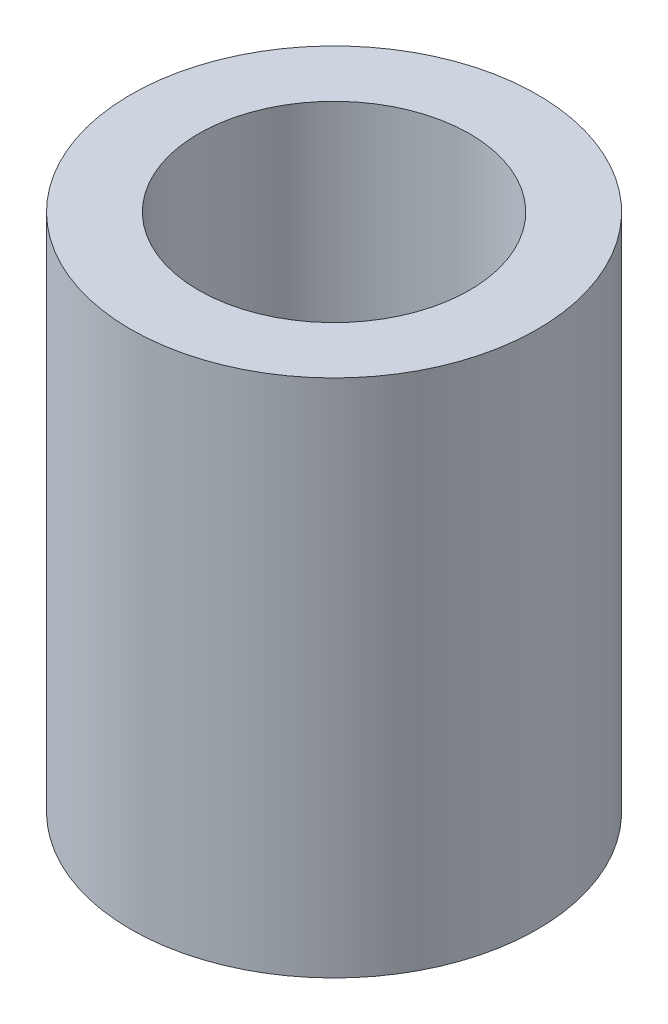
ISO-10303-21;
HEADER;
FILE_DESCRIPTION(('STEP AP214'),'2;1');
FILE_NAME('part.step','',(''),(''),'','','');
FILE_SCHEMA(('AUTOMOTIVE_DESIGN { 1 0 10303 214 1 1 1 1 }'));
ENDSEC;
DATA;
#1=APPLICATION_CONTEXT('core data for automotive mechanical design processes');
#2=APPLICATION_PROTOCOL_DEFINITION('international standard','automotive_design',2000,#1);
#3=PRODUCT_CONTEXT('',#1,'mechanical');
#4=PRODUCT('Part','Part','',(#3));
#5=PRODUCT_RELATED_PRODUCT_CATEGORY('part','',(#4));
#6=PRODUCT_DEFINITION_FORMATION('','',#4);
#7=PRODUCT_DEFINITION_CONTEXT('part definition',#1,'design');
#8=PRODUCT_DEFINITION('design','',#6,#7);
#9=PRODUCT_DEFINITION_SHAPE('','',#8);
#10=(LENGTH_UNIT() NAMED_UNIT(*) SI_UNIT(.MILLI.,.METRE.));
#11=(NAMED_UNIT(*) PLANE_ANGLE_UNIT() SI_UNIT($,.RADIAN.));
#12=(NAMED_UNIT(*) SI_UNIT($,.STERADIAN.) SOLID_ANGLE_UNIT());
#13=UNCERTAINTY_MEASURE_WITH_UNIT(LENGTH_MEASURE(1.E-05),#10,'distance_accuracy_value','');
#14=(GEOMETRIC_REPRESENTATION_CONTEXT(3) GLOBAL_UNCERTAINTY_ASSIGNED_CONTEXT((#13)) GLOBAL_UNIT_ASSIGNED_CONTEXT((#10,
#11,#12)) REPRESENTATION_CONTEXT('',''));
#15=CARTESIAN_POINT('',(0.,0.,0.));
#16=DIRECTION('',(0.,0.,1.));
#17=DIRECTION('',(1.,0.,0.));
#18=AXIS2_PLACEMENT_3D('',#15,#16,#17);
#19=CARTESIAN_POINT('',(-2.5,0.,1.5));
#20=DIRECTION('',(0.,1.,0.));
#21=DIRECTION('',(0.,0.,1.));
#22=AXIS2_PLACEMENT_3D('',#19,#20,#21);
#23=PLANE('',#22);
#24=CARTESIAN_POINT('',(-2.5,0.,1.5));
#25=DIRECTION('',(0.,1.,0.));
#26=DIRECTION('',(0.,0.,1.));
#27=AXIS2_PLACEMENT_3D('',#24,#25,#26);
#28=CIRCLE('',#27,4.5);
#29=CARTESIAN_POINT('',(-2.5,0.,6.));
#30=VERTEX_POINT('',#29);
#31=EDGE_CURVE('E11',#30,#30,#28,.T.);
#32=ORIENTED_EDGE('',*,*,#31,.F.);
#33=EDGE_LOOP('',(#32));
#34=FACE_BOUND('',#33,.T.);
#35=CARTESIAN_POINT('',(-4.5,0.,2.5));
#36=DIRECTION('',(0.,1.,0.));
#37=DIRECTION('',(0.,0.,-1.));
#38=AXIS2_PLACEMENT_3D('',#35,#36,#37);
#39=CIRCLE('',#38,0.5);
#40=CARTESIAN_POINT('',(-5.,0.,2.5));
#41=VERTEX_POINT('',#40);
#42=CARTESIAN_POINT('',(-4.5,0.,3.));
#43=VERTEX_POINT('',#42);
#44=EDGE_CURVE('E49',#41,#43,#39,.T.);
#45=ORIENTED_EDGE('',*,*,#44,.T.);
#46=DIRECTION('',(1.,0.,0.));
#47=VECTOR('',#46,1.);
#48=CARTESIAN_POINT('',(-0.500000000000003,0.,3.));
#49=LINE('',#48,#47);
#50=CARTESIAN_POINT('',(-0.500000000000003,0.,3.));
#51=VERTEX_POINT('',#50);
#52=EDGE_CURVE('E135',#43,#51,#49,.T.);
#53=ORIENTED_EDGE('',*,*,#52,.T.);
#54=CARTESIAN_POINT('',(-0.5,0.,2.5));
#55=DIRECTION('',(0.,1.,0.));
#56=DIRECTION('',(0.,0.,-1.));
#57=AXIS2_PLACEMENT_3D('',#54,#55,#56);
#58=CIRCLE('',#57,0.5);
#59=CARTESIAN_POINT('',(0.,0.,2.5));
#60=VERTEX_POINT('',#59);
#61=EDGE_CURVE('E138',#51,#60,#58,.T.);
#62=ORIENTED_EDGE('',*,*,#61,.T.);
#63=DIRECTION('',(0.,0.,-1.));
#64=VECTOR('',#63,1.);
#65=CARTESIAN_POINT('',(0.,0.,0.500000000000003));
#66=LINE('',#65,#64);
#67=CARTESIAN_POINT('',(0.,0.,0.500000000000003));
#68=VERTEX_POINT('',#67);
#69=EDGE_CURVE('E114',#60,#68,#66,.T.);
#70=ORIENTED_EDGE('',*,*,#69,.T.);
#71=CARTESIAN_POINT('',(-0.5,0.,0.5));
#72=DIRECTION('',(0.,1.,0.));
#73=DIRECTION('',(0.,0.,-1.));
#74=AXIS2_PLACEMENT_3D('',#71,#72,#73);
#75=CIRCLE('',#74,0.5);
#76=CARTESIAN_POINT('',(-0.500000000000003,0.,0.));
#77=VERTEX_POINT('',#76);
#78=EDGE_CURVE('E112',#68,#77,#75,.T.);
#79=ORIENTED_EDGE('',*,*,#78,.T.);
#80=DIRECTION('',(-1.,0.,0.));
#81=VECTOR('',#80,1.);
#82=CARTESIAN_POINT('',(-0.500000000000003,0.,0.));
#83=LINE('',#82,#81);
#84=CARTESIAN_POINT('',(-4.5,0.,0.));
#85=VERTEX_POINT('',#84);
#86=EDGE_CURVE('E91',#77,#85,#83,.T.);
#87=ORIENTED_EDGE('',*,*,#86,.T.);
#88=CARTESIAN_POINT('',(-4.5,0.,0.5));
#89=DIRECTION('',(0.,1.,0.));
#90=DIRECTION('',(0.,0.,-1.));
#91=AXIS2_PLACEMENT_3D('',#88,#89,#90);
#92=CIRCLE('',#91,0.5);
#93=CARTESIAN_POINT('',(-5.,0.,0.500000000000004));
#94=VERTEX_POINT('',#93);
#95=EDGE_CURVE('E102',#85,#94,#92,.T.);
#96=ORIENTED_EDGE('',*,*,#95,.T.);
#97=DIRECTION('',(0.,0.,1.));
#98=VECTOR('',#97,1.);
#99=CARTESIAN_POINT('',(-5.,0.,0.500000000000003));
#100=LINE('',#99,#98);
#101=EDGE_CURVE('E108',#94,#41,#100,.T.);
#102=ORIENTED_EDGE('',*,*,#101,.T.);
#103=EDGE_LOOP('',(#45,#53,#62,#70,#79,#87,#96,#102));
#104=FACE_BOUND('',#103,.T.);
#105=ADVANCED_FACE('F34',(#34,#104),#23,.F.);
#106=CARTESIAN_POINT('',(-2.5,5.5,1.5));
#107=DIRECTION('',(0.,-1.,0.));
#108=DIRECTION('',(0.,0.,-1.));
#109=AXIS2_PLACEMENT_3D('',#106,#107,#108);
#110=CYLINDRICAL_SURFACE('',#109,4.5);
#111=ORIENTED_EDGE('',*,*,#31,.T.);
#112=EDGE_LOOP('',(#111));
#113=FACE_BOUND('',#112,.T.);
#114=CARTESIAN_POINT('',(-2.5,11.5,1.5));
#115=DIRECTION('',(0.,1.,0.));
#116=DIRECTION('',(0.,0.,1.));
#117=AXIS2_PLACEMENT_3D('',#114,#115,#116);
#118=CIRCLE('',#117,4.5);
#119=CARTESIAN_POINT('',(-2.5,11.5,6.));
#120=VERTEX_POINT('',#119);
#121=EDGE_CURVE('E136',#120,#120,#118,.T.);
#122=ORIENTED_EDGE('',*,*,#121,.F.);
#123=EDGE_LOOP('',(#122));
#124=FACE_BOUND('',#123,.T.);
#125=ADVANCED_FACE('F36',(#113,#124),#110,.T.);
#126=CARTESIAN_POINT('',(-4.5,5.5,2.5));
#127=DIRECTION('',(0.,-1.,0.));
#128=DIRECTION('',(0.,0.,-1.));
#129=AXIS2_PLACEMENT_3D('',#126,#127,#128);
#130=CYLINDRICAL_SURFACE('',#129,0.5);
#131=ORIENTED_EDGE('',*,*,#44,.F.);
#132=DIRECTION('',(0.,-1.,0.));
#133=VECTOR('',#132,1.);
#134=CARTESIAN_POINT('',(-5.,5.5,2.5));
#135=LINE('',#134,#133);
#136=CARTESIAN_POINT('',(-5.,5.5,2.5));
#137=VERTEX_POINT('',#136);
#138=EDGE_CURVE('E119',#137,#41,#135,.T.);
#139=ORIENTED_EDGE('',*,*,#138,.F.);
#140=CARTESIAN_POINT('',(-4.5,5.5,2.5));
#141=DIRECTION('',(0.,1.,0.));
#142=DIRECTION('',(0.,0.,-1.));
#143=AXIS2_PLACEMENT_3D('',#140,#141,#142);
#144=CIRCLE('',#143,0.5);
#145=CARTESIAN_POINT('',(-4.5,5.5,3.));
#146=VERTEX_POINT('',#145);
#147=EDGE_CURVE('E58',#137,#146,#144,.T.);
#148=ORIENTED_EDGE('',*,*,#147,.T.);
#149=DIRECTION('',(0.,-1.,0.));
#150=VECTOR('',#149,1.);
#151=CARTESIAN_POINT('',(-4.5,5.5,3.));
#152=LINE('',#151,#150);
#153=EDGE_CURVE('E42',#146,#43,#152,.T.);
#154=ORIENTED_EDGE('',*,*,#153,.T.);
#155=EDGE_LOOP('',(#131,#139,#148,#154));
#156=FACE_BOUND('',#155,.T.);
#157=ADVANCED_FACE('F130',(#156),#130,.F.);
#158=CARTESIAN_POINT('',(-0.500000000000003,5.5,3.));
#159=DIRECTION('',(0.,0.,-1.));
#160=DIRECTION('',(-1.,0.,0.));
#161=AXIS2_PLACEMENT_3D('',#158,#159,#160);
#162=PLANE('',#161);
#163=ORIENTED_EDGE('',*,*,#52,.F.);
#164=ORIENTED_EDGE('',*,*,#153,.F.);
#165=DIRECTION('',(1.,0.,0.));
#166=VECTOR('',#165,1.);
#167=CARTESIAN_POINT('',(-0.500000000000003,5.5,3.));
#168=LINE('',#167,#166);
#169=CARTESIAN_POINT('',(-0.5,5.5,3.));
#170=VERTEX_POINT('',#169);
#171=EDGE_CURVE('E174',#146,#170,#168,.T.);
#172=ORIENTED_EDGE('',*,*,#171,.T.);
#173=DIRECTION('',(0.,-1.,0.));
#174=VECTOR('',#173,1.);
#175=CARTESIAN_POINT('',(-0.500000000000003,5.5,3.));
#176=LINE('',#175,#174);
#177=EDGE_CURVE('E128',#170,#51,#176,.T.);
#178=ORIENTED_EDGE('',*,*,#177,.T.);
#179=EDGE_LOOP('',(#163,#164,#172,#178));
#180=FACE_BOUND('',#179,.T.);
#181=ADVANCED_FACE('F205',(#180),#162,.T.);
#182=CARTESIAN_POINT('',(-0.5,5.5,2.5));
#183=DIRECTION('',(0.,-1.,0.));
#184=DIRECTION('',(0.,0.,-1.));
#185=AXIS2_PLACEMENT_3D('',#182,#183,#184);
#186=CYLINDRICAL_SURFACE('',#185,0.5);
#187=ORIENTED_EDGE('',*,*,#61,.F.);
#188=ORIENTED_EDGE('',*,*,#177,.F.);
#189=CARTESIAN_POINT('',(-0.5,5.5,2.5));
#190=DIRECTION('',(0.,1.,0.));
#191=DIRECTION('',(0.,0.,-1.));
#192=AXIS2_PLACEMENT_3D('',#189,#190,#191);
#193=CIRCLE('',#192,0.5);
#194=CARTESIAN_POINT('',(0.,5.5,2.5));
#195=VERTEX_POINT('',#194);
#196=EDGE_CURVE('E173',#170,#195,#193,.T.);
#197=ORIENTED_EDGE('',*,*,#196,.T.);
#198=DIRECTION('',(0.,-1.,0.));
#199=VECTOR('',#198,1.);
#200=CARTESIAN_POINT('',(0.,5.5,2.5));
#201=LINE('',#200,#199);
#202=EDGE_CURVE('E126',#195,#60,#201,.T.);
#203=ORIENTED_EDGE('',*,*,#202,.T.);
#204=EDGE_LOOP('',(#187,#188,#197,#203));
#205=FACE_BOUND('',#204,.T.);
#206=ADVANCED_FACE('F208',(#205),#186,.F.);
#207=CARTESIAN_POINT('',(0.,5.5,0.500000000000003));
#208=DIRECTION('',(-1.,0.,0.));
#209=DIRECTION('',(0.,0.,1.));
#210=AXIS2_PLACEMENT_3D('',#207,#208,#209);
#211=PLANE('',#210);
#212=ORIENTED_EDGE('',*,*,#69,.F.);
#213=ORIENTED_EDGE('',*,*,#202,.F.);
#214=DIRECTION('',(0.,0.,-1.));
#215=VECTOR('',#214,1.);
#216=CARTESIAN_POINT('',(0.,5.5,0.500000000000003));
#217=LINE('',#216,#215);
#218=CARTESIAN_POINT('',(0.,5.5,0.500000000000003));
#219=VERTEX_POINT('',#218);
#220=EDGE_CURVE('E156',#195,#219,#217,.T.);
#221=ORIENTED_EDGE('',*,*,#220,.T.);
#222=DIRECTION('',(0.,-1.,0.));
#223=VECTOR('',#222,1.);
#224=CARTESIAN_POINT('',(0.,5.5,0.500000000000003));
#225=LINE('',#224,#223);
#226=EDGE_CURVE('E124',#219,#68,#225,.T.);
#227=ORIENTED_EDGE('',*,*,#226,.T.);
#228=EDGE_LOOP('',(#212,#213,#221,#227));
#229=FACE_BOUND('',#228,.T.);
#230=ADVANCED_FACE('F150',(#229),#211,.T.);
#231=CARTESIAN_POINT('',(-0.5,5.5,0.5));
#232=DIRECTION('',(0.,-1.,0.));
#233=DIRECTION('',(0.,0.,-1.));
#234=AXIS2_PLACEMENT_3D('',#231,#232,#233);
#235=CYLINDRICAL_SURFACE('',#234,0.5);
#236=ORIENTED_EDGE('',*,*,#78,.F.);
#237=ORIENTED_EDGE('',*,*,#226,.F.);
#238=CARTESIAN_POINT('',(-0.5,5.5,0.5));
#239=DIRECTION('',(0.,1.,0.));
#240=DIRECTION('',(0.,0.,-1.));
#241=AXIS2_PLACEMENT_3D('',#238,#239,#240);
#242=CIRCLE('',#241,0.5);
#243=CARTESIAN_POINT('',(-0.500000000000003,5.5,0.));
#244=VERTEX_POINT('',#243);
#245=EDGE_CURVE('E162',#219,#244,#242,.T.);
#246=ORIENTED_EDGE('',*,*,#245,.T.);
#247=DIRECTION('',(0.,-1.,0.));
#248=VECTOR('',#247,1.);
#249=CARTESIAN_POINT('',(-0.500000000000003,5.5,0.));
#250=LINE('',#249,#248);
#251=EDGE_CURVE('E98',#244,#77,#250,.T.);
#252=ORIENTED_EDGE('',*,*,#251,.T.);
#253=EDGE_LOOP('',(#236,#237,#246,#252));
#254=FACE_BOUND('',#253,.T.);
#255=ADVANCED_FACE('F159',(#254),#235,.F.);
#256=CARTESIAN_POINT('',(-0.500000000000003,5.5,0.));
#257=DIRECTION('',(0.,0.,1.));
#258=DIRECTION('',(1.,0.,0.));
#259=AXIS2_PLACEMENT_3D('',#256,#257,#258);
#260=PLANE('',#259);
#261=ORIENTED_EDGE('',*,*,#86,.F.);
#262=ORIENTED_EDGE('',*,*,#251,.F.);
#263=DIRECTION('',(-1.,0.,0.));
#264=VECTOR('',#263,1.);
#265=CARTESIAN_POINT('',(-0.500000000000003,5.5,0.));
#266=LINE('',#265,#264);
#267=CARTESIAN_POINT('',(-4.5,5.5,0.));
#268=VERTEX_POINT('',#267);
#269=EDGE_CURVE('E95',#244,#268,#266,.T.);
#270=ORIENTED_EDGE('',*,*,#269,.T.);
#271=DIRECTION('',(0.,-1.,0.));
#272=VECTOR('',#271,1.);
#273=CARTESIAN_POINT('',(-4.5,5.5,0.));
#274=LINE('',#273,#272);
#275=EDGE_CURVE('E86',#268,#85,#274,.T.);
#276=ORIENTED_EDGE('',*,*,#275,.T.);
#277=EDGE_LOOP('',(#261,#262,#270,#276));
#278=FACE_BOUND('',#277,.T.);
#279=ADVANCED_FACE('F88',(#278),#260,.T.);
#280=CARTESIAN_POINT('',(-4.5,5.5,0.5));
#281=DIRECTION('',(0.,-1.,0.));
#282=DIRECTION('',(0.,0.,-1.));
#283=AXIS2_PLACEMENT_3D('',#280,#281,#282);
#284=CYLINDRICAL_SURFACE('',#283,0.5);
#285=ORIENTED_EDGE('',*,*,#95,.F.);
#286=ORIENTED_EDGE('',*,*,#275,.F.);
#287=CARTESIAN_POINT('',(-4.5,5.5,0.5));
#288=DIRECTION('',(0.,1.,0.));
#289=DIRECTION('',(0.,0.,-1.));
#290=AXIS2_PLACEMENT_3D('',#287,#288,#289);
#291=CIRCLE('',#290,0.5);
#292=CARTESIAN_POINT('',(-5.,5.5,0.500000000000004));
#293=VERTEX_POINT('',#292);
#294=EDGE_CURVE('E183',#268,#293,#291,.T.);
#295=ORIENTED_EDGE('',*,*,#294,.T.);
#296=DIRECTION('',(0.,-1.,0.));
#297=VECTOR('',#296,1.);
#298=CARTESIAN_POINT('',(-5.,5.5,0.500000000000004));
#299=LINE('',#298,#297);
#300=EDGE_CURVE('E99',#293,#94,#299,.T.);
#301=ORIENTED_EDGE('',*,*,#300,.T.);
#302=EDGE_LOOP('',(#285,#286,#295,#301));
#303=FACE_BOUND('',#302,.T.);
#304=ADVANCED_FACE('F103',(#303),#284,.F.);
#305=CARTESIAN_POINT('',(-5.,5.5,0.500000000000003));
#306=DIRECTION('',(1.,0.,0.));
#307=DIRECTION('',(0.,0.,-1.));
#308=AXIS2_PLACEMENT_3D('',#305,#306,#307);
#309=PLANE('',#308);
#310=ORIENTED_EDGE('',*,*,#101,.F.);
#311=ORIENTED_EDGE('',*,*,#300,.F.);
#312=DIRECTION('',(0.,0.,1.));
#313=VECTOR('',#312,1.);
#314=CARTESIAN_POINT('',(-5.,5.5,0.500000000000003));
#315=LINE('',#314,#313);
#316=EDGE_CURVE('E121',#293,#137,#315,.T.);
#317=ORIENTED_EDGE('',*,*,#316,.T.);
#318=ORIENTED_EDGE('',*,*,#138,.T.);
#319=EDGE_LOOP('',(#310,#311,#317,#318));
#320=FACE_BOUND('',#319,.T.);
#321=ADVANCED_FACE('F185',(#320),#309,.T.);
#322=CARTESIAN_POINT('',(-2.5,5.5,1.5));
#323=DIRECTION('',(0.,1.,0.));
#324=DIRECTION('',(0.,0.,1.));
#325=AXIS2_PLACEMENT_3D('',#322,#323,#324);
#326=PLANE('',#325);
#327=ORIENTED_EDGE('',*,*,#147,.F.);
#328=ORIENTED_EDGE('',*,*,#316,.F.);
#329=ORIENTED_EDGE('',*,*,#294,.F.);
#330=ORIENTED_EDGE('',*,*,#269,.F.);
#331=ORIENTED_EDGE('',*,*,#245,.F.);
#332=ORIENTED_EDGE('',*,*,#220,.F.);
#333=ORIENTED_EDGE('',*,*,#196,.F.);
#334=ORIENTED_EDGE('',*,*,#171,.F.);
#335=EDGE_LOOP('',(#327,#328,#329,#330,#331,#332,#333,#334));
#336=FACE_BOUND('',#335,.T.);
#337=ADVANCED_FACE('F175',(#336),#326,.F.);
#338=CARTESIAN_POINT('',(-2.5,11.5,1.5));
#339=DIRECTION('',(0.,1.,0.));
#340=DIRECTION('',(0.,0.,1.));
#341=AXIS2_PLACEMENT_3D('',#338,#339,#340);
#342=PLANE('',#341);
#343=CARTESIAN_POINT('',(-2.5,11.5,1.5));
#344=DIRECTION('',(0.,1.,0.));
#345=DIRECTION('',(0.,0.,1.));
#346=AXIS2_PLACEMENT_3D('',#343,#344,#345);
#347=CIRCLE('',#346,3.);
#348=CARTESIAN_POINT('',(-2.5,11.5,4.5));
#349=VERTEX_POINT('',#348);
#350=EDGE_CURVE('E271',#349,#349,#347,.T.);
#351=ORIENTED_EDGE('',*,*,#350,.F.);
#352=EDGE_LOOP('',(#351));
#353=FACE_BOUND('',#352,.T.);
#354=ORIENTED_EDGE('',*,*,#121,.T.);
#355=EDGE_LOOP('',(#354));
#356=FACE_BOUND('',#355,.T.);
#357=ADVANCED_FACE('F192',(#353,#356),#342,.T.);
#358=CARTESIAN_POINT('',(-2.5,6.5,1.5));
#359=DIRECTION('',(0.,1.,0.));
#360=DIRECTION('',(0.,0.,1.));
#361=AXIS2_PLACEMENT_3D('',#358,#359,#360);
#362=CYLINDRICAL_SURFACE('',#361,3.);
#363=CARTESIAN_POINT('',(-2.5,6.5,1.5));
#364=DIRECTION('',(0.,1.,0.));
#365=DIRECTION('',(0.,0.,1.));
#366=AXIS2_PLACEMENT_3D('',#363,#364,#365);
#367=CIRCLE('',#366,3.);
#368=CARTESIAN_POINT('',(-2.5,6.5,4.5));
#369=VERTEX_POINT('',#368);
#370=EDGE_CURVE('E141',#369,#369,#367,.T.);
#371=ORIENTED_EDGE('',*,*,#370,.F.);
#372=EDGE_LOOP('',(#371));
#373=FACE_BOUND('',#372,.T.);
#374=ORIENTED_EDGE('',*,*,#350,.T.);
#375=EDGE_LOOP('',(#374));
#376=FACE_BOUND('',#375,.T.);
#377=ADVANCED_FACE('F245',(#373,#376),#362,.F.);
#378=CARTESIAN_POINT('',(-2.5,6.5,1.5));
#379=DIRECTION('',(0.,1.,0.));
#380=DIRECTION('',(0.,0.,1.));
#381=AXIS2_PLACEMENT_3D('',#378,#379,#380);
#382=PLANE('',#381);
#383=ORIENTED_EDGE('',*,*,#370,.T.);
#384=EDGE_LOOP('',(#383));
#385=FACE_BOUND('',#384,.T.);
#386=ADVANCED_FACE('F255',(#385),#382,.T.);
#387=CLOSED_SHELL('',(#105,#125,#157,#181,#206,#230,#255,#279,#304,#321,#337,#357,#377,#386));
#388=MANIFOLD_SOLID_BREP('B2',#387);
#389=ADVANCED_BREP_SHAPE_REPRESENTATION('',(#18,#388),#14);
#390=SHAPE_DEFINITION_REPRESENTATION(#9,#389);
ENDSEC;
END-ISO-10303-21;
